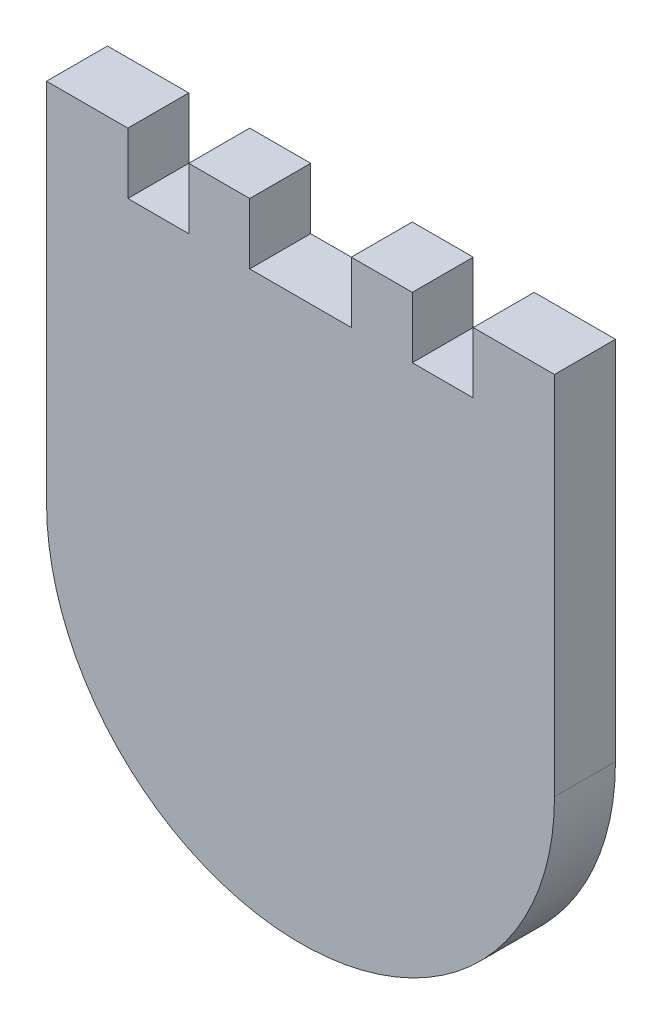
ISO-10303-21;
HEADER;
FILE_DESCRIPTION(('STEP AP214'),'2;1');
FILE_NAME('part.step','',(''),(''),'','','');
FILE_SCHEMA(('AUTOMOTIVE_DESIGN { 1 0 10303 214 1 1 1 1 }'));
ENDSEC;
DATA;
#1=APPLICATION_CONTEXT('core data for automotive mechanical design processes');
#2=APPLICATION_PROTOCOL_DEFINITION('international standard','automotive_design',2000,#1);
#3=PRODUCT_CONTEXT('',#1,'mechanical');
#4=PRODUCT('Part','Part','',(#3));
#5=PRODUCT_RELATED_PRODUCT_CATEGORY('part','',(#4));
#6=PRODUCT_DEFINITION_FORMATION('','',#4);
#7=PRODUCT_DEFINITION_CONTEXT('part definition',#1,'design');
#8=PRODUCT_DEFINITION('design','',#6,#7);
#9=PRODUCT_DEFINITION_SHAPE('','',#8);
#10=(LENGTH_UNIT() NAMED_UNIT(*) SI_UNIT(.MILLI.,.METRE.));
#11=(NAMED_UNIT(*) PLANE_ANGLE_UNIT() SI_UNIT($,.RADIAN.));
#12=(NAMED_UNIT(*) SI_UNIT($,.STERADIAN.) SOLID_ANGLE_UNIT());
#13=UNCERTAINTY_MEASURE_WITH_UNIT(LENGTH_MEASURE(1.E-05),#10,'distance_accuracy_value','');
#14=(GEOMETRIC_REPRESENTATION_CONTEXT(3) GLOBAL_UNCERTAINTY_ASSIGNED_CONTEXT((#13)) GLOBAL_UNIT_ASSIGNED_CONTEXT((#10,
#11,#12)) REPRESENTATION_CONTEXT('',''));
#15=CARTESIAN_POINT('',(0.,0.,0.));
#16=DIRECTION('',(0.,0.,1.));
#17=DIRECTION('',(1.,0.,0.));
#18=AXIS2_PLACEMENT_3D('',#15,#16,#17);
#19=CARTESIAN_POINT('',(-25.,30.,6.));
#20=DIRECTION('',(0.,1.,0.));
#21=DIRECTION('',(-1.,0.,0.));
#22=AXIS2_PLACEMENT_3D('',#19,#20,#21);
#23=PLANE('',#22);
#24=DIRECTION('',(0.,0.,-1.));
#25=VECTOR('',#24,1.);
#26=CARTESIAN_POINT('',(-4.99999999999999,30.,0.));
#27=LINE('',#26,#25);
#28=CARTESIAN_POINT('',(-4.99999999999999,30.,6.));
#29=VERTEX_POINT('',#28);
#30=CARTESIAN_POINT('',(-4.99999999999999,30.,0.));
#31=VERTEX_POINT('',#30);
#32=EDGE_CURVE('E395',#29,#31,#27,.T.);
#33=ORIENTED_EDGE('',*,*,#32,.F.);
#34=DIRECTION('',(1.,0.,0.));
#35=VECTOR('',#34,1.);
#36=CARTESIAN_POINT('',(-25.,30.,6.));
#37=LINE('',#36,#35);
#38=CARTESIAN_POINT('',(5.,30.,6.));
#39=VERTEX_POINT('',#38);
#40=EDGE_CURVE('E167',#29,#39,#37,.T.);
#41=ORIENTED_EDGE('',*,*,#40,.T.);
#42=DIRECTION('',(0.,0.,1.));
#43=VECTOR('',#42,1.);
#44=CARTESIAN_POINT('',(5.,30.,0.));
#45=LINE('',#44,#43);
#46=CARTESIAN_POINT('',(5.,30.,0.));
#47=VERTEX_POINT('',#46);
#48=EDGE_CURVE('E379',#47,#39,#45,.T.);
#49=ORIENTED_EDGE('',*,*,#48,.F.);
#50=DIRECTION('',(1.,0.,0.));
#51=VECTOR('',#50,1.);
#52=CARTESIAN_POINT('',(-25.,30.,0.));
#53=LINE('',#52,#51);
#54=EDGE_CURVE('E382',#31,#47,#53,.T.);
#55=ORIENTED_EDGE('',*,*,#54,.F.);
#56=EDGE_LOOP('',(#33,#41,#49,#55));
#57=FACE_BOUND('',#56,.T.);
#58=ADVANCED_FACE('F48',(#57),#23,.T.);
#59=DIRECTION('',(0.,0.,1.));
#60=VECTOR('',#59,1.);
#61=CARTESIAN_POINT('',(17.,30.,0.));
#62=LINE('',#61,#60);
#63=CARTESIAN_POINT('',(17.,30.,0.));
#64=VERTEX_POINT('',#63);
#65=CARTESIAN_POINT('',(17.,30.,6.));
#66=VERTEX_POINT('',#65);
#67=EDGE_CURVE('E160',#64,#66,#62,.T.);
#68=ORIENTED_EDGE('',*,*,#67,.F.);
#69=DIRECTION('',(1.,0.,0.));
#70=VECTOR('',#69,1.);
#71=CARTESIAN_POINT('',(-25.,30.,0.));
#72=LINE('',#71,#70);
#73=CARTESIAN_POINT('',(11.,30.,0.));
#74=VERTEX_POINT('',#73);
#75=EDGE_CURVE('E249',#74,#64,#72,.T.);
#76=ORIENTED_EDGE('',*,*,#75,.F.);
#77=DIRECTION('',(0.,0.,-1.));
#78=VECTOR('',#77,1.);
#79=CARTESIAN_POINT('',(11.,30.,0.));
#80=LINE('',#79,#78);
#81=CARTESIAN_POINT('',(11.,30.,6.));
#82=VERTEX_POINT('',#81);
#83=EDGE_CURVE('E68',#82,#74,#80,.T.);
#84=ORIENTED_EDGE('',*,*,#83,.F.);
#85=DIRECTION('',(1.,0.,0.));
#86=VECTOR('',#85,1.);
#87=CARTESIAN_POINT('',(-25.,30.,6.));
#88=LINE('',#87,#86);
#89=EDGE_CURVE('E157',#82,#66,#88,.T.);
#90=ORIENTED_EDGE('',*,*,#89,.T.);
#91=EDGE_LOOP('',(#68,#76,#84,#90));
#92=FACE_BOUND('',#91,.T.);
#93=ADVANCED_FACE('F159',(#92),#23,.T.);
#94=CARTESIAN_POINT('',(0.,0.,6.));
#95=DIRECTION('',(0.,0.,-1.));
#96=DIRECTION('',(-1.,0.,0.));
#97=AXIS2_PLACEMENT_3D('',#94,#95,#96);
#98=CYLINDRICAL_SURFACE('',#97,25.);
#99=DIRECTION('',(0.,0.,-1.));
#100=VECTOR('',#99,1.);
#101=CARTESIAN_POINT('',(25.,0.,6.));
#102=LINE('',#101,#100);
#103=CARTESIAN_POINT('',(25.,0.,6.));
#104=VERTEX_POINT('',#103);
#105=CARTESIAN_POINT('',(25.,0.,0.));
#106=VERTEX_POINT('',#105);
#107=EDGE_CURVE('E237',#104,#106,#102,.T.);
#108=ORIENTED_EDGE('',*,*,#107,.F.);
#109=CARTESIAN_POINT('',(0.,0.,6.));
#110=DIRECTION('',(0.,0.,1.));
#111=DIRECTION('',(1.,0.,0.));
#112=AXIS2_PLACEMENT_3D('',#109,#110,#111);
#113=CIRCLE('',#112,25.);
#114=CARTESIAN_POINT('',(-25.,0.,6.));
#115=VERTEX_POINT('',#114);
#116=EDGE_CURVE('E12',#115,#104,#113,.T.);
#117=ORIENTED_EDGE('',*,*,#116,.F.);
#118=DIRECTION('',(0.,0.,-1.));
#119=VECTOR('',#118,1.);
#120=CARTESIAN_POINT('',(-25.,0.,6.));
#121=LINE('',#120,#119);
#122=CARTESIAN_POINT('',(-25.,0.,0.));
#123=VERTEX_POINT('',#122);
#124=EDGE_CURVE('E250',#115,#123,#121,.T.);
#125=ORIENTED_EDGE('',*,*,#124,.T.);
#126=CARTESIAN_POINT('',(0.,0.,0.));
#127=DIRECTION('',(0.,0.,1.));
#128=DIRECTION('',(1.,0.,0.));
#129=AXIS2_PLACEMENT_3D('',#126,#127,#128);
#130=CIRCLE('',#129,25.);
#131=EDGE_CURVE('E59',#123,#106,#130,.T.);
#132=ORIENTED_EDGE('',*,*,#131,.T.);
#133=EDGE_LOOP('',(#108,#117,#125,#132));
#134=FACE_BOUND('',#133,.T.);
#135=ADVANCED_FACE('F488',(#134),#98,.T.);
#136=CARTESIAN_POINT('',(0.,0.,6.));
#137=DIRECTION('',(0.,0.,-1.));
#138=DIRECTION('',(-1.,0.,0.));
#139=AXIS2_PLACEMENT_3D('',#136,#137,#138);
#140=CYLINDRICAL_SURFACE('',#139,3.6);
#141=DIRECTION('',(0.,0.,-1.));
#142=VECTOR('',#141,1.);
#143=CARTESIAN_POINT('',(-2.73463725984306,2.34131566796919,6.));
#144=LINE('',#143,#142);
#145=CARTESIAN_POINT('',(-2.73463725984306,2.34131566796919,2.));
#146=VERTEX_POINT('',#145);
#147=CARTESIAN_POINT('',(-2.73463725984306,2.34131566796919,0.));
#148=VERTEX_POINT('',#147);
#149=EDGE_CURVE('E319',#146,#148,#144,.T.);
#150=ORIENTED_EDGE('',*,*,#149,.F.);
#151=CARTESIAN_POINT('',(0.,0.,2.));
#152=DIRECTION('',(0.,0.,1.));
#153=DIRECTION('',(1.,0.,0.));
#154=AXIS2_PLACEMENT_3D('',#151,#152,#153);
#155=CIRCLE('',#154,3.6);
#156=CARTESIAN_POINT('',(-2.73463725984306,-2.34131566796919,2.));
#157=VERTEX_POINT('',#156);
#158=EDGE_CURVE('E271',#146,#157,#155,.T.);
#159=ORIENTED_EDGE('',*,*,#158,.T.);
#160=DIRECTION('',(0.,0.,-1.));
#161=VECTOR('',#160,1.);
#162=CARTESIAN_POINT('',(-2.73463725984306,-2.34131566796919,6.));
#163=LINE('',#162,#161);
#164=CARTESIAN_POINT('',(-2.73463725984306,-2.34131566796919,0.));
#165=VERTEX_POINT('',#164);
#166=EDGE_CURVE('E347',#157,#165,#163,.T.);
#167=ORIENTED_EDGE('',*,*,#166,.T.);
#168=CARTESIAN_POINT('',(0.,0.,0.));
#169=DIRECTION('',(0.,0.,1.));
#170=DIRECTION('',(1.,0.,0.));
#171=AXIS2_PLACEMENT_3D('',#168,#169,#170);
#172=CIRCLE('',#171,3.6);
#173=EDGE_CURVE('E287',#148,#165,#172,.T.);
#174=ORIENTED_EDGE('',*,*,#173,.F.);
#175=EDGE_LOOP('',(#150,#159,#167,#174));
#176=FACE_BOUND('',#175,.T.);
#177=ADVANCED_FACE('F646',(#176),#140,.F.);
#178=CARTESIAN_POINT('',(-2.73463725984306,-2.34131566796919,6.));
#179=DIRECTION('',(0.996802062784257,0.0799102473344275,0.));
#180=DIRECTION('',(-0.0799102473344275,0.996802062784257,0.));
#181=AXIS2_PLACEMENT_3D('',#178,#179,#180);
#182=PLANE('',#181);
#183=ORIENTED_EDGE('',*,*,#166,.F.);
#184=DIRECTION('',(0.0799102473344275,-0.996802062784257,0.));
#185=VECTOR('',#184,1.);
#186=CARTESIAN_POINT('',(-2.73463725984306,-2.34131566796919,2.));
#187=LINE('',#186,#185);
#188=CARTESIAN_POINT('',(-1.8,-14.,2.));
#189=VERTEX_POINT('',#188);
#190=EDGE_CURVE('E275',#157,#189,#187,.T.);
#191=ORIENTED_EDGE('',*,*,#190,.T.);
#192=DIRECTION('',(0.,0.,-1.));
#193=VECTOR('',#192,1.);
#194=CARTESIAN_POINT('',(-1.8,-14.,6.));
#195=LINE('',#194,#193);
#196=CARTESIAN_POINT('',(-1.8,-14.,0.));
#197=VERTEX_POINT('',#196);
#198=EDGE_CURVE('E343',#189,#197,#195,.T.);
#199=ORIENTED_EDGE('',*,*,#198,.T.);
#200=DIRECTION('',(0.0799102473344275,-0.996802062784257,0.));
#201=VECTOR('',#200,1.);
#202=CARTESIAN_POINT('',(-2.73463725984306,-2.34131566796919,0.));
#203=LINE('',#202,#201);
#204=EDGE_CURVE('E291',#165,#197,#203,.T.);
#205=ORIENTED_EDGE('',*,*,#204,.F.);
#206=EDGE_LOOP('',(#183,#191,#199,#205));
#207=FACE_BOUND('',#206,.T.);
#208=ADVANCED_FACE('F737',(#207),#182,.T.);
#209=CARTESIAN_POINT('',(0.,-14.,6.));
#210=DIRECTION('',(0.,0.,-1.));
#211=DIRECTION('',(-1.,0.,0.));
#212=AXIS2_PLACEMENT_3D('',#209,#210,#211);
#213=CYLINDRICAL_SURFACE('',#212,1.8);
#214=ORIENTED_EDGE('',*,*,#198,.F.);
#215=CARTESIAN_POINT('',(0.,-14.,2.));
#216=DIRECTION('',(0.,0.,1.));
#217=DIRECTION('',(1.,0.,0.));
#218=AXIS2_PLACEMENT_3D('',#215,#216,#217);
#219=CIRCLE('',#218,1.8);
#220=CARTESIAN_POINT('',(1.8,-14.,2.));
#221=VERTEX_POINT('',#220);
#222=EDGE_CURVE('E279',#189,#221,#219,.T.);
#223=ORIENTED_EDGE('',*,*,#222,.T.);
#224=DIRECTION('',(0.,0.,-1.));
#225=VECTOR('',#224,1.);
#226=CARTESIAN_POINT('',(1.8,-14.,6.));
#227=LINE('',#226,#225);
#228=CARTESIAN_POINT('',(1.8,-14.,0.));
#229=VERTEX_POINT('',#228);
#230=EDGE_CURVE('E339',#221,#229,#227,.T.);
#231=ORIENTED_EDGE('',*,*,#230,.T.);
#232=CARTESIAN_POINT('',(0.,-14.,0.));
#233=DIRECTION('',(0.,0.,1.));
#234=DIRECTION('',(1.,0.,0.));
#235=AXIS2_PLACEMENT_3D('',#232,#233,#234);
#236=CIRCLE('',#235,1.8);
#237=EDGE_CURVE('E295',#197,#229,#236,.T.);
#238=ORIENTED_EDGE('',*,*,#237,.F.);
#239=EDGE_LOOP('',(#214,#223,#231,#238));
#240=FACE_BOUND('',#239,.T.);
#241=ADVANCED_FACE('F672',(#240),#213,.F.);
#242=CARTESIAN_POINT('',(2.73463725984307,-2.34131566796919,6.));
#243=DIRECTION('',(-0.996802062784257,0.079910247334428,0.));
#244=DIRECTION('',(-0.079910247334428,-0.996802062784257,0.));
#245=AXIS2_PLACEMENT_3D('',#242,#243,#244);
#246=PLANE('',#245);
#247=ORIENTED_EDGE('',*,*,#230,.F.);
#248=DIRECTION('',(0.0799102473344274,0.996802062784257,0.));
#249=VECTOR('',#248,1.);
#250=CARTESIAN_POINT('',(1.8,-14.,2.));
#251=LINE('',#250,#249);
#252=CARTESIAN_POINT('',(2.73463725984307,-2.34131566796919,2.));
#253=VERTEX_POINT('',#252);
#254=EDGE_CURVE('E283',#221,#253,#251,.T.);
#255=ORIENTED_EDGE('',*,*,#254,.T.);
#256=DIRECTION('',(0.,0.,-1.));
#257=VECTOR('',#256,1.);
#258=CARTESIAN_POINT('',(2.73463725984307,-2.34131566796919,6.));
#259=LINE('',#258,#257);
#260=CARTESIAN_POINT('',(2.73463725984307,-2.34131566796919,0.));
#261=VERTEX_POINT('',#260);
#262=EDGE_CURVE('E335',#253,#261,#259,.T.);
#263=ORIENTED_EDGE('',*,*,#262,.T.);
#264=DIRECTION('',(0.079910247334428,0.996802062784257,0.));
#265=VECTOR('',#264,1.);
#266=CARTESIAN_POINT('',(2.73463725984307,-2.34131566796919,0.));
#267=LINE('',#266,#265);
#268=EDGE_CURVE('E299',#229,#261,#267,.T.);
#269=ORIENTED_EDGE('',*,*,#268,.F.);
#270=EDGE_LOOP('',(#247,#255,#263,#269));
#271=FACE_BOUND('',#270,.T.);
#272=ADVANCED_FACE('F668',(#271),#246,.T.);
#273=CARTESIAN_POINT('',(0.,0.,6.));
#274=DIRECTION('',(0.,0.,-1.));
#275=DIRECTION('',(-1.,0.,0.));
#276=AXIS2_PLACEMENT_3D('',#273,#274,#275);
#277=CYLINDRICAL_SURFACE('',#276,3.6);
#278=ORIENTED_EDGE('',*,*,#262,.F.);
#279=CARTESIAN_POINT('',(0.,0.,2.));
#280=DIRECTION('',(0.,0.,1.));
#281=DIRECTION('',(1.,0.,0.));
#282=AXIS2_PLACEMENT_3D('',#279,#280,#281);
#283=CIRCLE('',#282,3.6);
#284=CARTESIAN_POINT('',(2.73463725984307,2.34131566796919,2.));
#285=VERTEX_POINT('',#284);
#286=EDGE_CURVE('E254',#253,#285,#283,.T.);
#287=ORIENTED_EDGE('',*,*,#286,.T.);
#288=DIRECTION('',(0.,0.,-1.));
#289=VECTOR('',#288,1.);
#290=CARTESIAN_POINT('',(2.73463725984307,2.34131566796919,6.));
#291=LINE('',#290,#289);
#292=CARTESIAN_POINT('',(2.73463725984307,2.34131566796919,0.));
#293=VERTEX_POINT('',#292);
#294=EDGE_CURVE('E331',#285,#293,#291,.T.);
#295=ORIENTED_EDGE('',*,*,#294,.T.);
#296=CARTESIAN_POINT('',(0.,0.,0.));
#297=DIRECTION('',(0.,0.,1.));
#298=DIRECTION('',(-1.,0.,0.));
#299=AXIS2_PLACEMENT_3D('',#296,#297,#298);
#300=CIRCLE('',#299,3.6);
#301=EDGE_CURVE('E303',#261,#293,#300,.T.);
#302=ORIENTED_EDGE('',*,*,#301,.F.);
#303=EDGE_LOOP('',(#278,#287,#295,#302));
#304=FACE_BOUND('',#303,.T.);
#305=ADVANCED_FACE('F671',(#304),#277,.F.);
#306=CARTESIAN_POINT('',(2.73463725984307,2.34131566796919,6.));
#307=DIRECTION('',(-0.996802062784257,-0.079910247334428,0.));
#308=DIRECTION('',(0.079910247334428,-0.996802062784257,0.));
#309=AXIS2_PLACEMENT_3D('',#306,#307,#308);
#310=PLANE('',#309);
#311=ORIENTED_EDGE('',*,*,#294,.F.);
#312=DIRECTION('',(-0.079910247334428,0.996802062784257,0.));
#313=VECTOR('',#312,1.);
#314=CARTESIAN_POINT('',(2.73463725984307,2.34131566796919,2.));
#315=LINE('',#314,#313);
#316=CARTESIAN_POINT('',(1.8,14.,2.));
#317=VERTEX_POINT('',#316);
#318=EDGE_CURVE('E259',#285,#317,#315,.T.);
#319=ORIENTED_EDGE('',*,*,#318,.T.);
#320=DIRECTION('',(0.,0.,-1.));
#321=VECTOR('',#320,1.);
#322=CARTESIAN_POINT('',(1.8,14.,6.));
#323=LINE('',#322,#321);
#324=CARTESIAN_POINT('',(1.8,14.,0.));
#325=VERTEX_POINT('',#324);
#326=EDGE_CURVE('E327',#317,#325,#323,.T.);
#327=ORIENTED_EDGE('',*,*,#326,.T.);
#328=DIRECTION('',(-0.079910247334428,0.996802062784257,0.));
#329=VECTOR('',#328,1.);
#330=CARTESIAN_POINT('',(2.73463725984307,2.34131566796919,0.));
#331=LINE('',#330,#329);
#332=EDGE_CURVE('E307',#293,#325,#331,.T.);
#333=ORIENTED_EDGE('',*,*,#332,.F.);
#334=EDGE_LOOP('',(#311,#319,#327,#333));
#335=FACE_BOUND('',#334,.T.);
#336=ADVANCED_FACE('F682',(#335),#310,.T.);
#337=CARTESIAN_POINT('',(0.,14.,6.));
#338=DIRECTION('',(0.,0.,-1.));
#339=DIRECTION('',(-1.,0.,0.));
#340=AXIS2_PLACEMENT_3D('',#337,#338,#339);
#341=CYLINDRICAL_SURFACE('',#340,1.8);
#342=ORIENTED_EDGE('',*,*,#326,.F.);
#343=CARTESIAN_POINT('',(0.,14.,2.));
#344=DIRECTION('',(0.,0.,1.));
#345=DIRECTION('',(1.,0.,0.));
#346=AXIS2_PLACEMENT_3D('',#343,#344,#345);
#347=CIRCLE('',#346,1.8);
#348=CARTESIAN_POINT('',(-1.79999999999999,14.,2.));
#349=VERTEX_POINT('',#348);
#350=EDGE_CURVE('E263',#317,#349,#347,.T.);
#351=ORIENTED_EDGE('',*,*,#350,.T.);
#352=DIRECTION('',(0.,0.,-1.));
#353=VECTOR('',#352,1.);
#354=CARTESIAN_POINT('',(-1.79999999999999,14.,6.));
#355=LINE('',#354,#353);
#356=CARTESIAN_POINT('',(-1.79999999999999,14.,0.));
#357=VERTEX_POINT('',#356);
#358=EDGE_CURVE('E323',#349,#357,#355,.T.);
#359=ORIENTED_EDGE('',*,*,#358,.T.);
#360=CARTESIAN_POINT('',(0.,14.,0.));
#361=DIRECTION('',(0.,0.,1.));
#362=DIRECTION('',(-1.,0.,0.));
#363=AXIS2_PLACEMENT_3D('',#360,#361,#362);
#364=CIRCLE('',#363,1.8);
#365=EDGE_CURVE('E311',#325,#357,#364,.T.);
#366=ORIENTED_EDGE('',*,*,#365,.F.);
#367=EDGE_LOOP('',(#342,#351,#359,#366));
#368=FACE_BOUND('',#367,.T.);
#369=ADVANCED_FACE('F692',(#368),#341,.F.);
#370=CARTESIAN_POINT('',(-2.73463725984306,2.34131566796919,6.));
#371=DIRECTION('',(0.996802062784257,-0.0799102473344275,0.));
#372=DIRECTION('',(0.0799102473344275,0.996802062784257,0.));
#373=AXIS2_PLACEMENT_3D('',#370,#371,#372);
#374=PLANE('',#373);
#375=ORIENTED_EDGE('',*,*,#358,.F.);
#376=DIRECTION('',(-0.0799102473344275,-0.996802062784257,0.));
#377=VECTOR('',#376,1.);
#378=CARTESIAN_POINT('',(-1.8,14.,2.));
#379=LINE('',#378,#377);
#380=EDGE_CURVE('E267',#349,#146,#379,.T.);
#381=ORIENTED_EDGE('',*,*,#380,.T.);
#382=ORIENTED_EDGE('',*,*,#149,.T.);
#383=DIRECTION('',(-0.0799102473344275,-0.996802062784257,0.));
#384=VECTOR('',#383,1.);
#385=CARTESIAN_POINT('',(-2.73463725984306,2.34131566796919,0.));
#386=LINE('',#385,#384);
#387=EDGE_CURVE('E315',#357,#148,#386,.T.);
#388=ORIENTED_EDGE('',*,*,#387,.F.);
#389=EDGE_LOOP('',(#375,#381,#382,#388));
#390=FACE_BOUND('',#389,.T.);
#391=ADVANCED_FACE('F702',(#390),#374,.T.);
#392=CARTESIAN_POINT('',(0.,0.,6.));
#393=DIRECTION('',(0.,0.,1.));
#394=DIRECTION('',(1.,0.,0.));
#395=AXIS2_PLACEMENT_3D('',#392,#393,#394);
#396=PLANE('',#395);
#397=ORIENTED_EDGE('',*,*,#116,.T.);
#398=DIRECTION('',(0.,1.,0.));
#399=VECTOR('',#398,1.);
#400=CARTESIAN_POINT('',(25.,0.,6.));
#401=LINE('',#400,#399);
#402=CARTESIAN_POINT('',(25.,36.,6.));
#403=VERTEX_POINT('',#402);
#404=EDGE_CURVE('E240',#104,#403,#401,.T.);
#405=ORIENTED_EDGE('',*,*,#404,.T.);
#406=DIRECTION('',(1.,0.,0.));
#407=VECTOR('',#406,1.);
#408=CARTESIAN_POINT('',(0.,36.,6.));
#409=LINE('',#408,#407);
#410=CARTESIAN_POINT('',(17.,36.,6.));
#411=VERTEX_POINT('',#410);
#412=EDGE_CURVE('E185',#411,#403,#409,.T.);
#413=ORIENTED_EDGE('',*,*,#412,.F.);
#414=DIRECTION('',(0.,-1.,0.));
#415=VECTOR('',#414,1.);
#416=CARTESIAN_POINT('',(17.,31.,6.));
#417=LINE('',#416,#415);
#418=EDGE_CURVE('E175',#411,#66,#417,.T.);
#419=ORIENTED_EDGE('',*,*,#418,.T.);
#420=ORIENTED_EDGE('',*,*,#89,.F.);
#421=DIRECTION('',(0.,-1.,0.));
#422=VECTOR('',#421,1.);
#423=CARTESIAN_POINT('',(11.,31.,6.));
#424=LINE('',#423,#422);
#425=CARTESIAN_POINT('',(11.,36.,6.));
#426=VERTEX_POINT('',#425);
#427=EDGE_CURVE('E224',#426,#82,#424,.T.);
#428=ORIENTED_EDGE('',*,*,#427,.F.);
#429=DIRECTION('',(1.,0.,0.));
#430=VECTOR('',#429,1.);
#431=CARTESIAN_POINT('',(0.,36.,6.));
#432=LINE('',#431,#430);
#433=CARTESIAN_POINT('',(5.,36.,6.));
#434=VERTEX_POINT('',#433);
#435=EDGE_CURVE('E227',#434,#426,#432,.T.);
#436=ORIENTED_EDGE('',*,*,#435,.F.);
#437=DIRECTION('',(0.,-1.,0.));
#438=VECTOR('',#437,1.);
#439=CARTESIAN_POINT('',(5.,31.,6.));
#440=LINE('',#439,#438);
#441=EDGE_CURVE('E220',#434,#39,#440,.T.);
#442=ORIENTED_EDGE('',*,*,#441,.T.);
#443=ORIENTED_EDGE('',*,*,#40,.F.);
#444=DIRECTION('',(0.,-1.,0.));
#445=VECTOR('',#444,1.);
#446=CARTESIAN_POINT('',(-4.99999999999999,31.,6.));
#447=LINE('',#446,#445);
#448=CARTESIAN_POINT('',(-4.99999999999999,36.,6.));
#449=VERTEX_POINT('',#448);
#450=EDGE_CURVE('E202',#449,#29,#447,.T.);
#451=ORIENTED_EDGE('',*,*,#450,.F.);
#452=DIRECTION('',(1.,0.,0.));
#453=VECTOR('',#452,1.);
#454=CARTESIAN_POINT('',(0.,36.,6.));
#455=LINE('',#454,#453);
#456=CARTESIAN_POINT('',(-11.,36.,6.));
#457=VERTEX_POINT('',#456);
#458=EDGE_CURVE('E414',#457,#449,#455,.T.);
#459=ORIENTED_EDGE('',*,*,#458,.F.);
#460=DIRECTION('',(0.,-1.,0.));
#461=VECTOR('',#460,1.);
#462=CARTESIAN_POINT('',(-11.,31.,6.));
#463=LINE('',#462,#461);
#464=CARTESIAN_POINT('',(-11.,30.,6.));
#465=VERTEX_POINT('',#464);
#466=EDGE_CURVE('E198',#457,#465,#463,.T.);
#467=ORIENTED_EDGE('',*,*,#466,.T.);
#468=DIRECTION('',(1.,0.,0.));
#469=VECTOR('',#468,1.);
#470=CARTESIAN_POINT('',(-25.,30.,6.));
#471=LINE('',#470,#469);
#472=CARTESIAN_POINT('',(-17.,30.,6.));
#473=VERTEX_POINT('',#472);
#474=EDGE_CURVE('E255',#473,#465,#471,.T.);
#475=ORIENTED_EDGE('',*,*,#474,.F.);
#476=DIRECTION('',(0.,-1.,0.));
#477=VECTOR('',#476,1.);
#478=CARTESIAN_POINT('',(-17.,31.,6.));
#479=LINE('',#478,#477);
#480=CARTESIAN_POINT('',(-17.,36.,6.));
#481=VERTEX_POINT('',#480);
#482=EDGE_CURVE('E228',#481,#473,#479,.T.);
#483=ORIENTED_EDGE('',*,*,#482,.F.);
#484=DIRECTION('',(1.,0.,0.));
#485=VECTOR('',#484,1.);
#486=CARTESIAN_POINT('',(0.,36.,6.));
#487=LINE('',#486,#485);
#488=CARTESIAN_POINT('',(-25.,36.,6.));
#489=VERTEX_POINT('',#488);
#490=EDGE_CURVE('E362',#489,#481,#487,.T.);
#491=ORIENTED_EDGE('',*,*,#490,.F.);
#492=DIRECTION('',(0.,1.,0.));
#493=VECTOR('',#492,1.);
#494=CARTESIAN_POINT('',(-25.,0.,6.));
#495=LINE('',#494,#493);
#496=EDGE_CURVE('E168',#115,#489,#495,.T.);
#497=ORIENTED_EDGE('',*,*,#496,.F.);
#498=EDGE_LOOP('',(#397,#405,#413,#419,#420,#428,#436,#442,#443,#451,#459,#467,#475,#483,#491,#497));
#499=FACE_BOUND('',#498,.T.);
#500=ADVANCED_FACE('F183',(#499),#396,.T.);
#501=CARTESIAN_POINT('',(0.,0.,0.));
#502=DIRECTION('',(0.,0.,1.));
#503=DIRECTION('',(1.,0.,0.));
#504=AXIS2_PLACEMENT_3D('',#501,#502,#503);
#505=PLANE('',#504);
#506=ORIENTED_EDGE('',*,*,#131,.F.);
#507=DIRECTION('',(0.,1.,0.));
#508=VECTOR('',#507,1.);
#509=CARTESIAN_POINT('',(-25.,0.,0.));
#510=LINE('',#509,#508);
#511=CARTESIAN_POINT('',(-25.,36.,0.));
#512=VERTEX_POINT('',#511);
#513=EDGE_CURVE('E133',#123,#512,#510,.T.);
#514=ORIENTED_EDGE('',*,*,#513,.T.);
#515=DIRECTION('',(-1.,0.,0.));
#516=VECTOR('',#515,1.);
#517=CARTESIAN_POINT('',(0.,36.,0.));
#518=LINE('',#517,#516);
#519=CARTESIAN_POINT('',(-17.,36.,0.));
#520=VERTEX_POINT('',#519);
#521=EDGE_CURVE('E354',#520,#512,#518,.T.);
#522=ORIENTED_EDGE('',*,*,#521,.F.);
#523=DIRECTION('',(0.,-1.,0.));
#524=VECTOR('',#523,1.);
#525=CARTESIAN_POINT('',(-17.,31.,0.));
#526=LINE('',#525,#524);
#527=CARTESIAN_POINT('',(-17.,30.,0.));
#528=VERTEX_POINT('',#527);
#529=EDGE_CURVE('E232',#520,#528,#526,.T.);
#530=ORIENTED_EDGE('',*,*,#529,.T.);
#531=DIRECTION('',(1.,0.,0.));
#532=VECTOR('',#531,1.);
#533=CARTESIAN_POINT('',(-25.,30.,0.));
#534=LINE('',#533,#532);
#535=CARTESIAN_POINT('',(-11.,30.,0.));
#536=VERTEX_POINT('',#535);
#537=EDGE_CURVE('E52',#528,#536,#534,.T.);
#538=ORIENTED_EDGE('',*,*,#537,.T.);
#539=DIRECTION('',(0.,-1.,0.));
#540=VECTOR('',#539,1.);
#541=CARTESIAN_POINT('',(-11.,31.,0.));
#542=LINE('',#541,#540);
#543=CARTESIAN_POINT('',(-11.,36.,0.));
#544=VERTEX_POINT('',#543);
#545=EDGE_CURVE('E194',#544,#536,#542,.T.);
#546=ORIENTED_EDGE('',*,*,#545,.F.);
#547=DIRECTION('',(-1.,0.,0.));
#548=VECTOR('',#547,1.);
#549=CARTESIAN_POINT('',(0.,36.,0.));
#550=LINE('',#549,#548);
#551=CARTESIAN_POINT('',(-4.99999999999999,36.,0.));
#552=VERTEX_POINT('',#551);
#553=EDGE_CURVE('E399',#552,#544,#550,.T.);
#554=ORIENTED_EDGE('',*,*,#553,.F.);
#555=DIRECTION('',(0.,-1.,0.));
#556=VECTOR('',#555,1.);
#557=CARTESIAN_POINT('',(-4.99999999999999,31.,0.));
#558=LINE('',#557,#556);
#559=EDGE_CURVE('E206',#552,#31,#558,.T.);
#560=ORIENTED_EDGE('',*,*,#559,.T.);
#561=ORIENTED_EDGE('',*,*,#54,.T.);
#562=DIRECTION('',(0.,-1.,0.));
#563=VECTOR('',#562,1.);
#564=CARTESIAN_POINT('',(5.,31.,0.));
#565=LINE('',#564,#563);
#566=CARTESIAN_POINT('',(5.,36.,0.));
#567=VERTEX_POINT('',#566);
#568=EDGE_CURVE('E215',#567,#47,#565,.T.);
#569=ORIENTED_EDGE('',*,*,#568,.F.);
#570=DIRECTION('',(-1.,0.,0.));
#571=VECTOR('',#570,1.);
#572=CARTESIAN_POINT('',(0.,36.,0.));
#573=LINE('',#572,#571);
#574=CARTESIAN_POINT('',(11.,36.,0.));
#575=VERTEX_POINT('',#574);
#576=EDGE_CURVE('E387',#575,#567,#573,.T.);
#577=ORIENTED_EDGE('',*,*,#576,.F.);
#578=DIRECTION('',(0.,-1.,0.));
#579=VECTOR('',#578,1.);
#580=CARTESIAN_POINT('',(11.,31.,0.));
#581=LINE('',#580,#579);
#582=EDGE_CURVE('E211',#575,#74,#581,.T.);
#583=ORIENTED_EDGE('',*,*,#582,.T.);
#584=ORIENTED_EDGE('',*,*,#75,.T.);
#585=DIRECTION('',(0.,-1.,0.));
#586=VECTOR('',#585,1.);
#587=CARTESIAN_POINT('',(17.,31.,0.));
#588=LINE('',#587,#586);
#589=CARTESIAN_POINT('',(17.,36.,0.));
#590=VERTEX_POINT('',#589);
#591=EDGE_CURVE('E178',#590,#64,#588,.T.);
#592=ORIENTED_EDGE('',*,*,#591,.F.);
#593=DIRECTION('',(-1.,0.,0.));
#594=VECTOR('',#593,1.);
#595=CARTESIAN_POINT('',(0.,36.,0.));
#596=LINE('',#595,#594);
#597=CARTESIAN_POINT('',(25.,36.,0.));
#598=VERTEX_POINT('',#597);
#599=EDGE_CURVE('E371',#598,#590,#596,.T.);
#600=ORIENTED_EDGE('',*,*,#599,.F.);
#601=DIRECTION('',(0.,1.,0.));
#602=VECTOR('',#601,1.);
#603=CARTESIAN_POINT('',(25.,0.,0.));
#604=LINE('',#603,#602);
#605=EDGE_CURVE('E155',#106,#598,#604,.T.);
#606=ORIENTED_EDGE('',*,*,#605,.F.);
#607=EDGE_LOOP('',(#506,#514,#522,#530,#538,#546,#554,#560,#561,#569,#577,#583,#584,#592,#600,#606));
#608=FACE_BOUND('',#607,.T.);
#609=ORIENTED_EDGE('',*,*,#173,.T.);
#610=ORIENTED_EDGE('',*,*,#204,.T.);
#611=ORIENTED_EDGE('',*,*,#237,.T.);
#612=ORIENTED_EDGE('',*,*,#268,.T.);
#613=ORIENTED_EDGE('',*,*,#301,.T.);
#614=ORIENTED_EDGE('',*,*,#332,.T.);
#615=ORIENTED_EDGE('',*,*,#365,.T.);
#616=ORIENTED_EDGE('',*,*,#387,.T.);
#617=EDGE_LOOP('',(#609,#610,#611,#612,#613,#614,#615,#616));
#618=FACE_BOUND('',#617,.T.);
#619=ADVANCED_FACE('F431',(#608,#618),#505,.F.);
#620=CARTESIAN_POINT('',(0.,0.,2.));
#621=DIRECTION('',(0.,0.,1.));
#622=DIRECTION('',(1.,0.,0.));
#623=AXIS2_PLACEMENT_3D('',#620,#621,#622);
#624=PLANE('',#623);
#625=ORIENTED_EDGE('',*,*,#286,.F.);
#626=ORIENTED_EDGE('',*,*,#254,.F.);
#627=ORIENTED_EDGE('',*,*,#222,.F.);
#628=ORIENTED_EDGE('',*,*,#190,.F.);
#629=ORIENTED_EDGE('',*,*,#158,.F.);
#630=ORIENTED_EDGE('',*,*,#380,.F.);
#631=ORIENTED_EDGE('',*,*,#350,.F.);
#632=ORIENTED_EDGE('',*,*,#318,.F.);
#633=EDGE_LOOP('',(#625,#626,#627,#628,#629,#630,#631,#632));
#634=FACE_BOUND('',#633,.T.);
#635=ADVANCED_FACE('F530',(#634),#624,.F.);
#636=DIRECTION('',(0.,0.,1.));
#637=VECTOR('',#636,1.);
#638=CARTESIAN_POINT('',(-11.,30.,0.));
#639=LINE('',#638,#637);
#640=EDGE_CURVE('E181',#536,#465,#639,.T.);
#641=ORIENTED_EDGE('',*,*,#640,.F.);
#642=ORIENTED_EDGE('',*,*,#537,.F.);
#643=DIRECTION('',(0.,0.,-1.));
#644=VECTOR('',#643,1.);
#645=CARTESIAN_POINT('',(-17.,30.,0.));
#646=LINE('',#645,#644);
#647=EDGE_CURVE('E216',#473,#528,#646,.T.);
#648=ORIENTED_EDGE('',*,*,#647,.F.);
#649=ORIENTED_EDGE('',*,*,#474,.T.);
#650=EDGE_LOOP('',(#641,#642,#648,#649));
#651=FACE_BOUND('',#650,.T.);
#652=ADVANCED_FACE('F520',(#651),#23,.T.);
#653=CARTESIAN_POINT('',(-25.,0.,6.));
#654=DIRECTION('',(-1.,0.,0.));
#655=DIRECTION('',(0.,0.,1.));
#656=AXIS2_PLACEMENT_3D('',#653,#654,#655);
#657=PLANE('',#656);
#658=ORIENTED_EDGE('',*,*,#513,.F.);
#659=ORIENTED_EDGE('',*,*,#124,.F.);
#660=ORIENTED_EDGE('',*,*,#496,.T.);
#661=DIRECTION('',(0.,0.,1.));
#662=VECTOR('',#661,1.);
#663=CARTESIAN_POINT('',(-25.,36.,6.));
#664=LINE('',#663,#662);
#665=EDGE_CURVE('E358',#512,#489,#664,.T.);
#666=ORIENTED_EDGE('',*,*,#665,.F.);
#667=EDGE_LOOP('',(#658,#659,#660,#666));
#668=FACE_BOUND('',#667,.T.);
#669=ADVANCED_FACE('F522',(#668),#657,.T.);
#670=CARTESIAN_POINT('',(25.,0.,6.));
#671=DIRECTION('',(1.,0.,0.));
#672=DIRECTION('',(0.,0.,1.));
#673=AXIS2_PLACEMENT_3D('',#670,#671,#672);
#674=PLANE('',#673);
#675=ORIENTED_EDGE('',*,*,#605,.T.);
#676=DIRECTION('',(0.,0.,-1.));
#677=VECTOR('',#676,1.);
#678=CARTESIAN_POINT('',(25.,36.,6.));
#679=LINE('',#678,#677);
#680=EDGE_CURVE('E180',#403,#598,#679,.T.);
#681=ORIENTED_EDGE('',*,*,#680,.F.);
#682=ORIENTED_EDGE('',*,*,#404,.F.);
#683=ORIENTED_EDGE('',*,*,#107,.T.);
#684=EDGE_LOOP('',(#675,#681,#682,#683));
#685=FACE_BOUND('',#684,.T.);
#686=ADVANCED_FACE('F491',(#685),#674,.T.);
#687=CARTESIAN_POINT('',(-17.,31.,0.));
#688=DIRECTION('',(-1.,0.,0.));
#689=DIRECTION('',(0.,-1.,0.));
#690=AXIS2_PLACEMENT_3D('',#687,#688,#689);
#691=PLANE('',#690);
#692=ORIENTED_EDGE('',*,*,#647,.T.);
#693=ORIENTED_EDGE('',*,*,#529,.F.);
#694=DIRECTION('',(0.,0.,-1.));
#695=VECTOR('',#694,1.);
#696=CARTESIAN_POINT('',(-17.,36.,0.));
#697=LINE('',#696,#695);
#698=EDGE_CURVE('E236',#481,#520,#697,.T.);
#699=ORIENTED_EDGE('',*,*,#698,.F.);
#700=ORIENTED_EDGE('',*,*,#482,.T.);
#701=EDGE_LOOP('',(#692,#693,#699,#700));
#702=FACE_BOUND('',#701,.T.);
#703=ADVANCED_FACE('F426',(#702),#691,.F.);
#704=CARTESIAN_POINT('',(0.,36.,0.));
#705=DIRECTION('',(0.,-1.,0.));
#706=DIRECTION('',(0.,0.,-1.));
#707=AXIS2_PLACEMENT_3D('',#704,#705,#706);
#708=PLANE('',#707);
#709=ORIENTED_EDGE('',*,*,#521,.T.);
#710=ORIENTED_EDGE('',*,*,#665,.T.);
#711=ORIENTED_EDGE('',*,*,#490,.T.);
#712=ORIENTED_EDGE('',*,*,#698,.T.);
#713=EDGE_LOOP('',(#709,#710,#711,#712));
#714=FACE_BOUND('',#713,.T.);
#715=ADVANCED_FACE('F436',(#714),#708,.F.);
#716=CARTESIAN_POINT('',(11.,31.,0.));
#717=DIRECTION('',(-1.,0.,0.));
#718=DIRECTION('',(0.,-1.,0.));
#719=AXIS2_PLACEMENT_3D('',#716,#717,#718);
#720=PLANE('',#719);
#721=ORIENTED_EDGE('',*,*,#83,.T.);
#722=ORIENTED_EDGE('',*,*,#582,.F.);
#723=DIRECTION('',(0.,0.,-1.));
#724=VECTOR('',#723,1.);
#725=CARTESIAN_POINT('',(11.,36.,0.));
#726=LINE('',#725,#724);
#727=EDGE_CURVE('E383',#426,#575,#726,.T.);
#728=ORIENTED_EDGE('',*,*,#727,.F.);
#729=ORIENTED_EDGE('',*,*,#427,.T.);
#730=EDGE_LOOP('',(#721,#722,#728,#729));
#731=FACE_BOUND('',#730,.T.);
#732=ADVANCED_FACE('F498',(#731),#720,.F.);
#733=CARTESIAN_POINT('',(5.,31.,0.));
#734=DIRECTION('',(1.,0.,0.));
#735=DIRECTION('',(0.,1.,0.));
#736=AXIS2_PLACEMENT_3D('',#733,#734,#735);
#737=PLANE('',#736);
#738=ORIENTED_EDGE('',*,*,#48,.T.);
#739=ORIENTED_EDGE('',*,*,#441,.F.);
#740=DIRECTION('',(0.,0.,1.));
#741=VECTOR('',#740,1.);
#742=CARTESIAN_POINT('',(5.,36.,0.));
#743=LINE('',#742,#741);
#744=EDGE_CURVE('E390',#567,#434,#743,.T.);
#745=ORIENTED_EDGE('',*,*,#744,.F.);
#746=ORIENTED_EDGE('',*,*,#568,.T.);
#747=EDGE_LOOP('',(#738,#739,#745,#746));
#748=FACE_BOUND('',#747,.T.);
#749=ADVANCED_FACE('F506',(#748),#737,.F.);
#750=CARTESIAN_POINT('',(0.,36.,0.));
#751=DIRECTION('',(0.,-1.,0.));
#752=DIRECTION('',(0.,0.,-1.));
#753=AXIS2_PLACEMENT_3D('',#750,#751,#752);
#754=PLANE('',#753);
#755=ORIENTED_EDGE('',*,*,#727,.T.);
#756=ORIENTED_EDGE('',*,*,#576,.T.);
#757=ORIENTED_EDGE('',*,*,#744,.T.);
#758=ORIENTED_EDGE('',*,*,#435,.T.);
#759=EDGE_LOOP('',(#755,#756,#757,#758));
#760=FACE_BOUND('',#759,.T.);
#761=ADVANCED_FACE('F503',(#760),#754,.F.);
#762=CARTESIAN_POINT('',(-11.,31.,0.));
#763=DIRECTION('',(1.,0.,0.));
#764=DIRECTION('',(0.,1.,0.));
#765=AXIS2_PLACEMENT_3D('',#762,#763,#764);
#766=PLANE('',#765);
#767=ORIENTED_EDGE('',*,*,#640,.T.);
#768=ORIENTED_EDGE('',*,*,#466,.F.);
#769=DIRECTION('',(0.,0.,1.));
#770=VECTOR('',#769,1.);
#771=CARTESIAN_POINT('',(-11.,36.,0.));
#772=LINE('',#771,#770);
#773=EDGE_CURVE('E411',#544,#457,#772,.T.);
#774=ORIENTED_EDGE('',*,*,#773,.F.);
#775=ORIENTED_EDGE('',*,*,#545,.T.);
#776=EDGE_LOOP('',(#767,#768,#774,#775));
#777=FACE_BOUND('',#776,.T.);
#778=ADVANCED_FACE('F519',(#777),#766,.F.);
#779=CARTESIAN_POINT('',(-4.99999999999999,31.,0.));
#780=DIRECTION('',(-1.,0.,0.));
#781=DIRECTION('',(0.,-1.,0.));
#782=AXIS2_PLACEMENT_3D('',#779,#780,#781);
#783=PLANE('',#782);
#784=ORIENTED_EDGE('',*,*,#32,.T.);
#785=ORIENTED_EDGE('',*,*,#559,.F.);
#786=DIRECTION('',(0.,0.,-1.));
#787=VECTOR('',#786,1.);
#788=CARTESIAN_POINT('',(-4.99999999999999,36.,0.));
#789=LINE('',#788,#787);
#790=EDGE_CURVE('E210',#449,#552,#789,.T.);
#791=ORIENTED_EDGE('',*,*,#790,.F.);
#792=ORIENTED_EDGE('',*,*,#450,.T.);
#793=EDGE_LOOP('',(#784,#785,#791,#792));
#794=FACE_BOUND('',#793,.T.);
#795=ADVANCED_FACE('F512',(#794),#783,.F.);
#796=CARTESIAN_POINT('',(0.,36.,0.));
#797=DIRECTION('',(0.,-1.,0.));
#798=DIRECTION('',(0.,0.,-1.));
#799=AXIS2_PLACEMENT_3D('',#796,#797,#798);
#800=PLANE('',#799);
#801=ORIENTED_EDGE('',*,*,#553,.T.);
#802=ORIENTED_EDGE('',*,*,#773,.T.);
#803=ORIENTED_EDGE('',*,*,#458,.T.);
#804=ORIENTED_EDGE('',*,*,#790,.T.);
#805=EDGE_LOOP('',(#801,#802,#803,#804));
#806=FACE_BOUND('',#805,.T.);
#807=ADVANCED_FACE('F517',(#806),#800,.F.);
#808=CARTESIAN_POINT('',(17.,31.,0.));
#809=DIRECTION('',(1.,0.,0.));
#810=DIRECTION('',(0.,1.,0.));
#811=AXIS2_PLACEMENT_3D('',#808,#809,#810);
#812=PLANE('',#811);
#813=ORIENTED_EDGE('',*,*,#67,.T.);
#814=ORIENTED_EDGE('',*,*,#418,.F.);
#815=DIRECTION('',(0.,0.,1.));
#816=VECTOR('',#815,1.);
#817=CARTESIAN_POINT('',(17.,36.,0.));
#818=LINE('',#817,#816);
#819=EDGE_CURVE('E191',#590,#411,#818,.T.);
#820=ORIENTED_EDGE('',*,*,#819,.F.);
#821=ORIENTED_EDGE('',*,*,#591,.T.);
#822=EDGE_LOOP('',(#813,#814,#820,#821));
#823=FACE_BOUND('',#822,.T.);
#824=ADVANCED_FACE('F173',(#823),#812,.F.);
#825=CARTESIAN_POINT('',(0.,36.,0.));
#826=DIRECTION('',(0.,-1.,0.));
#827=DIRECTION('',(0.,0.,-1.));
#828=AXIS2_PLACEMENT_3D('',#825,#826,#827);
#829=PLANE('',#828);
#830=ORIENTED_EDGE('',*,*,#680,.T.);
#831=ORIENTED_EDGE('',*,*,#599,.T.);
#832=ORIENTED_EDGE('',*,*,#819,.T.);
#833=ORIENTED_EDGE('',*,*,#412,.T.);
#834=EDGE_LOOP('',(#830,#831,#832,#833));
#835=FACE_BOUND('',#834,.T.);
#836=ADVANCED_FACE('F50',(#835),#829,.F.);
#837=CLOSED_SHELL('',(#58,#93,#135,#177,#208,#241,#272,#305,#336,#369,#391,#500,#619,#635,#652,
#669,#686,#703,#715,#732,#749,#761,#778,#795,#807,#824,#836));
#838=MANIFOLD_SOLID_BREP('B2',#837);
#839=ADVANCED_BREP_SHAPE_REPRESENTATION('',(#18,#838),#14);
#840=SHAPE_DEFINITION_REPRESENTATION(#9,#839);
ENDSEC;
END-ISO-10303-21;
